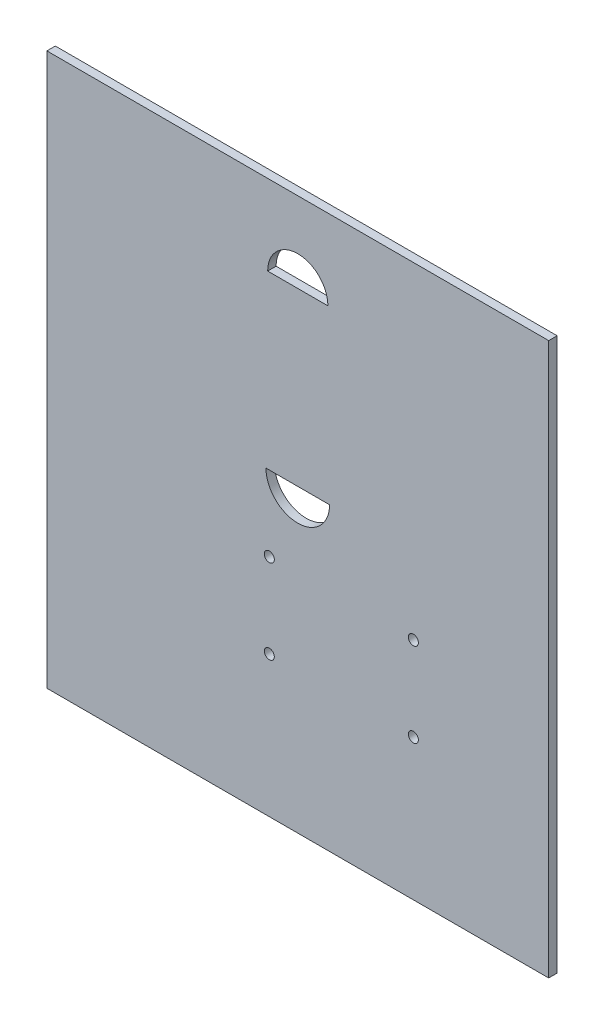
ISO-10303-21;
HEADER;
FILE_DESCRIPTION(('STEP AP214'),'2;1');
FILE_NAME('part.step','',(''),(''),'','','');
FILE_SCHEMA(('AUTOMOTIVE_DESIGN { 1 0 10303 214 1 1 1 1 }'));
ENDSEC;
DATA;
#1=APPLICATION_CONTEXT('core data for automotive mechanical design processes');
#2=APPLICATION_PROTOCOL_DEFINITION('international standard','automotive_design',2000,#1);
#3=PRODUCT_CONTEXT('',#1,'mechanical');
#4=PRODUCT('Part','Part','',(#3));
#5=PRODUCT_RELATED_PRODUCT_CATEGORY('part','',(#4));
#6=PRODUCT_DEFINITION_FORMATION('','',#4);
#7=PRODUCT_DEFINITION_CONTEXT('part definition',#1,'design');
#8=PRODUCT_DEFINITION('design','',#6,#7);
#9=PRODUCT_DEFINITION_SHAPE('','',#8);
#10=(LENGTH_UNIT() NAMED_UNIT(*) SI_UNIT(.MILLI.,.METRE.));
#11=(NAMED_UNIT(*) PLANE_ANGLE_UNIT() SI_UNIT($,.RADIAN.));
#12=(NAMED_UNIT(*) SI_UNIT($,.STERADIAN.) SOLID_ANGLE_UNIT());
#13=UNCERTAINTY_MEASURE_WITH_UNIT(LENGTH_MEASURE(1.E-05),#10,'distance_accuracy_value','');
#14=(GEOMETRIC_REPRESENTATION_CONTEXT(3) GLOBAL_UNCERTAINTY_ASSIGNED_CONTEXT((#13)) GLOBAL_UNIT_ASSIGNED_CONTEXT((#10,
#11,#12)) REPRESENTATION_CONTEXT('',''));
#15=CARTESIAN_POINT('',(0.,0.,0.));
#16=DIRECTION('',(0.,0.,1.));
#17=DIRECTION('',(1.,0.,0.));
#18=AXIS2_PLACEMENT_3D('',#15,#16,#17);
#19=CARTESIAN_POINT('',(-220.228215767635,110.114107883817,4.2));
#20=DIRECTION('',(1.,0.,0.));
#21=DIRECTION('',(0.,0.,-1.));
#22=AXIS2_PLACEMENT_3D('',#19,#20,#21);
#23=PLANE('',#22);
#24=DIRECTION('',(0.,-1.,0.));
#25=VECTOR('',#24,1.);
#26=CARTESIAN_POINT('',(-220.228215767635,110.114107883817,0.));
#27=LINE('',#26,#25);
#28=CARTESIAN_POINT('',(-220.228215767635,110.114107883817,0.));
#29=VERTEX_POINT('',#28);
#30=CARTESIAN_POINT('',(-220.228215767635,-164.885892116183,0.));
#31=VERTEX_POINT('',#30);
#32=EDGE_CURVE('E122',#29,#31,#27,.T.);
#33=ORIENTED_EDGE('',*,*,#32,.T.);
#34=DIRECTION('',(0.,0.,-1.));
#35=VECTOR('',#34,1.);
#36=CARTESIAN_POINT('',(-220.228215767635,-164.885892116183,4.2));
#37=LINE('',#36,#35);
#38=CARTESIAN_POINT('',(-220.228215767635,-164.885892116183,4.2));
#39=VERTEX_POINT('',#38);
#40=EDGE_CURVE('E11',#39,#31,#37,.T.);
#41=ORIENTED_EDGE('',*,*,#40,.F.);
#42=DIRECTION('',(0.,-1.,0.));
#43=VECTOR('',#42,1.);
#44=CARTESIAN_POINT('',(-220.228215767635,110.114107883817,4.2));
#45=LINE('',#44,#43);
#46=CARTESIAN_POINT('',(-220.228215767635,110.114107883817,4.2));
#47=VERTEX_POINT('',#46);
#48=EDGE_CURVE('E161',#47,#39,#45,.T.);
#49=ORIENTED_EDGE('',*,*,#48,.F.);
#50=DIRECTION('',(0.,0.,-1.));
#51=VECTOR('',#50,1.);
#52=CARTESIAN_POINT('',(-220.228215767635,110.114107883817,4.2));
#53=LINE('',#52,#51);
#54=EDGE_CURVE('E171',#47,#29,#53,.T.);
#55=ORIENTED_EDGE('',*,*,#54,.T.);
#56=EDGE_LOOP('',(#33,#41,#49,#55));
#57=FACE_BOUND('',#56,.T.);
#58=ADVANCED_FACE('F37',(#57),#23,.F.);
#59=CARTESIAN_POINT('',(-220.228215767635,-164.885892116183,4.2));
#60=DIRECTION('',(0.,1.,0.));
#61=DIRECTION('',(-1.,0.,0.));
#62=AXIS2_PLACEMENT_3D('',#59,#60,#61);
#63=PLANE('',#62);
#64=DIRECTION('',(1.,0.,0.));
#65=VECTOR('',#64,1.);
#66=CARTESIAN_POINT('',(-220.228215767635,-164.885892116183,0.));
#67=LINE('',#66,#65);
#68=CARTESIAN_POINT('',(29.7717842323652,-164.885892116183,0.));
#69=VERTEX_POINT('',#68);
#70=EDGE_CURVE('E174',#31,#69,#67,.T.);
#71=ORIENTED_EDGE('',*,*,#70,.T.);
#72=DIRECTION('',(0.,0.,-1.));
#73=VECTOR('',#72,1.);
#74=CARTESIAN_POINT('',(29.7717842323652,-164.885892116183,4.2));
#75=LINE('',#74,#73);
#76=CARTESIAN_POINT('',(29.7717842323652,-164.885892116183,4.2));
#77=VERTEX_POINT('',#76);
#78=EDGE_CURVE('E44',#77,#69,#75,.T.);
#79=ORIENTED_EDGE('',*,*,#78,.F.);
#80=DIRECTION('',(1.,0.,0.));
#81=VECTOR('',#80,1.);
#82=CARTESIAN_POINT('',(-220.228215767635,-164.885892116183,4.2));
#83=LINE('',#82,#81);
#84=EDGE_CURVE('E164',#39,#77,#83,.T.);
#85=ORIENTED_EDGE('',*,*,#84,.F.);
#86=ORIENTED_EDGE('',*,*,#40,.T.);
#87=EDGE_LOOP('',(#71,#79,#85,#86));
#88=FACE_BOUND('',#87,.T.);
#89=ADVANCED_FACE('F203',(#88),#63,.F.);
#90=CARTESIAN_POINT('',(29.7717842323651,110.114107883817,4.2));
#91=DIRECTION('',(-1.,0.,0.));
#92=DIRECTION('',(0.,-1.,0.));
#93=AXIS2_PLACEMENT_3D('',#90,#91,#92);
#94=PLANE('',#93);
#95=DIRECTION('',(0.,1.,0.));
#96=VECTOR('',#95,1.);
#97=CARTESIAN_POINT('',(29.7717842323651,110.114107883817,0.));
#98=LINE('',#97,#96);
#99=CARTESIAN_POINT('',(29.7717842323651,110.114107883817,0.));
#100=VERTEX_POINT('',#99);
#101=EDGE_CURVE('E176',#69,#100,#98,.T.);
#102=ORIENTED_EDGE('',*,*,#101,.T.);
#103=DIRECTION('',(0.,0.,-1.));
#104=VECTOR('',#103,1.);
#105=CARTESIAN_POINT('',(29.7717842323651,110.114107883817,4.2));
#106=LINE('',#105,#104);
#107=CARTESIAN_POINT('',(29.7717842323651,110.114107883817,4.2));
#108=VERTEX_POINT('',#107);
#109=EDGE_CURVE('E181',#108,#100,#106,.T.);
#110=ORIENTED_EDGE('',*,*,#109,.F.);
#111=DIRECTION('',(0.,1.,0.));
#112=VECTOR('',#111,1.);
#113=CARTESIAN_POINT('',(29.7717842323651,110.114107883817,4.2));
#114=LINE('',#113,#112);
#115=EDGE_CURVE('E167',#77,#108,#114,.T.);
#116=ORIENTED_EDGE('',*,*,#115,.F.);
#117=ORIENTED_EDGE('',*,*,#78,.T.);
#118=EDGE_LOOP('',(#102,#110,#116,#117));
#119=FACE_BOUND('',#118,.T.);
#120=ADVANCED_FACE('F188',(#119),#94,.F.);
#121=CARTESIAN_POINT('',(-220.228215767635,110.114107883817,4.2));
#122=DIRECTION('',(0.,-1.,0.));
#123=DIRECTION('',(0.,0.,-1.));
#124=AXIS2_PLACEMENT_3D('',#121,#122,#123);
#125=PLANE('',#124);
#126=DIRECTION('',(-1.,0.,0.));
#127=VECTOR('',#126,1.);
#128=CARTESIAN_POINT('',(-220.228215767635,110.114107883817,0.));
#129=LINE('',#128,#127);
#130=EDGE_CURVE('E165',#100,#29,#129,.T.);
#131=ORIENTED_EDGE('',*,*,#130,.T.);
#132=ORIENTED_EDGE('',*,*,#54,.F.);
#133=DIRECTION('',(-1.,0.,0.));
#134=VECTOR('',#133,1.);
#135=CARTESIAN_POINT('',(-220.228215767635,110.114107883817,4.2));
#136=LINE('',#135,#134);
#137=EDGE_CURVE('E169',#108,#47,#136,.T.);
#138=ORIENTED_EDGE('',*,*,#137,.F.);
#139=ORIENTED_EDGE('',*,*,#109,.T.);
#140=EDGE_LOOP('',(#131,#132,#138,#139));
#141=FACE_BOUND('',#140,.T.);
#142=ADVANCED_FACE('F196',(#141),#125,.F.);
#143=CARTESIAN_POINT('',(0.,0.,4.2));
#144=DIRECTION('',(0.,0.,1.));
#145=DIRECTION('',(1.,0.,0.));
#146=AXIS2_PLACEMENT_3D('',#143,#144,#145);
#147=PLANE('',#146);
#148=CARTESIAN_POINT('',(-95.2282157676349,70.1141078838174,4.2));
#149=DIRECTION('',(0.,0.,1.));
#150=DIRECTION('',(-1.,0.,0.));
#151=AXIS2_PLACEMENT_3D('',#148,#149,#150);
#152=CIRCLE('',#151,15.);
#153=CARTESIAN_POINT('',(-80.2282157676349,70.1141078838174,4.2));
#154=VERTEX_POINT('',#153);
#155=CARTESIAN_POINT('',(-110.228215767635,70.1141078838174,4.2));
#156=VERTEX_POINT('',#155);
#157=EDGE_CURVE('E51',#154,#156,#152,.T.);
#158=ORIENTED_EDGE('',*,*,#157,.F.);
#159=DIRECTION('',(1.,0.,0.));
#160=VECTOR('',#159,1.);
#161=CARTESIAN_POINT('',(-110.228215767635,70.1141078838174,4.2));
#162=LINE('',#161,#160);
#163=EDGE_CURVE('E116',#156,#154,#162,.T.);
#164=ORIENTED_EDGE('',*,*,#163,.F.);
#165=EDGE_LOOP('',(#158,#164));
#166=FACE_BOUND('',#165,.T.);
#167=CARTESIAN_POINT('',(-109.410669773119,-52.7391791909621,4.2));
#168=DIRECTION('',(0.,0.,1.));
#169=DIRECTION('',(1.,0.,0.));
#170=AXIS2_PLACEMENT_3D('',#167,#168,#169);
#171=CIRCLE('',#170,2.50000008);
#172=CARTESIAN_POINT('',(-106.910669693119,-52.7391791909621,4.2));
#173=VERTEX_POINT('',#172);
#174=EDGE_CURVE('E128',#173,#173,#171,.T.);
#175=ORIENTED_EDGE('',*,*,#174,.F.);
#176=EDGE_LOOP('',(#175));
#177=FACE_BOUND('',#176,.T.);
#178=CARTESIAN_POINT('',(-37.6556697731191,-94.6491791909619,4.2));
#179=DIRECTION('',(0.,0.,1.));
#180=DIRECTION('',(1.,0.,0.));
#181=AXIS2_PLACEMENT_3D('',#178,#179,#180);
#182=CIRCLE('',#181,2.50000007999997);
#183=CARTESIAN_POINT('',(-35.1556696931191,-94.6491791909619,4.2));
#184=VERTEX_POINT('',#183);
#185=EDGE_CURVE('E144',#184,#184,#182,.T.);
#186=ORIENTED_EDGE('',*,*,#185,.F.);
#187=EDGE_LOOP('',(#186));
#188=FACE_BOUND('',#187,.T.);
#189=CARTESIAN_POINT('',(-95.2282157676349,-15.3058921161826,4.2));
#190=DIRECTION('',(0.,0.,1.));
#191=DIRECTION('',(1.,0.,0.));
#192=AXIS2_PLACEMENT_3D('',#189,#190,#191);
#193=CIRCLE('',#192,15.8456781145647);
#194=CARTESIAN_POINT('',(-111.0738938822,-15.3058921161826,4.2));
#195=VERTEX_POINT('',#194);
#196=CARTESIAN_POINT('',(-79.3825376530702,-15.3058921161826,4.2));
#197=VERTEX_POINT('',#196);
#198=EDGE_CURVE('E59',#195,#197,#193,.T.);
#199=ORIENTED_EDGE('',*,*,#198,.F.);
#200=DIRECTION('',(-1.,0.,0.));
#201=VECTOR('',#200,1.);
#202=CARTESIAN_POINT('',(-111.0738938822,-15.3058921161826,4.2));
#203=LINE('',#202,#201);
#204=EDGE_CURVE('E152',#197,#195,#203,.T.);
#205=ORIENTED_EDGE('',*,*,#204,.F.);
#206=EDGE_LOOP('',(#199,#205));
#207=FACE_BOUND('',#206,.T.);
#208=CARTESIAN_POINT('',(-37.6556697731192,-52.7391791909619,4.2));
#209=DIRECTION('',(0.,0.,1.));
#210=DIRECTION('',(1.,0.,0.));
#211=AXIS2_PLACEMENT_3D('',#208,#209,#210);
#212=CIRCLE('',#211,2.50000008);
#213=CARTESIAN_POINT('',(-35.1556696931192,-52.7391791909619,4.2));
#214=VERTEX_POINT('',#213);
#215=EDGE_CURVE('E134',#214,#214,#212,.T.);
#216=ORIENTED_EDGE('',*,*,#215,.F.);
#217=EDGE_LOOP('',(#216));
#218=FACE_BOUND('',#217,.T.);
#219=CARTESIAN_POINT('',(-109.410669773119,-94.6491791909621,4.2));
#220=DIRECTION('',(0.,0.,1.));
#221=DIRECTION('',(1.,0.,0.));
#222=AXIS2_PLACEMENT_3D('',#219,#220,#221);
#223=CIRCLE('',#222,2.50000007999999);
#224=CARTESIAN_POINT('',(-106.910669693119,-94.6491791909621,4.2));
#225=VERTEX_POINT('',#224);
#226=EDGE_CURVE('E127',#225,#225,#223,.T.);
#227=ORIENTED_EDGE('',*,*,#226,.F.);
#228=EDGE_LOOP('',(#227));
#229=FACE_BOUND('',#228,.T.);
#230=ORIENTED_EDGE('',*,*,#48,.T.);
#231=ORIENTED_EDGE('',*,*,#84,.T.);
#232=ORIENTED_EDGE('',*,*,#115,.T.);
#233=ORIENTED_EDGE('',*,*,#137,.T.);
#234=EDGE_LOOP('',(#230,#231,#232,#233));
#235=FACE_BOUND('',#234,.T.);
#236=ADVANCED_FACE('F202',(#166,#177,#188,#207,#218,#229,#235),#147,.T.);
#237=CARTESIAN_POINT('',(0.,0.,0.));
#238=DIRECTION('',(0.,0.,1.));
#239=DIRECTION('',(1.,0.,0.));
#240=AXIS2_PLACEMENT_3D('',#237,#238,#239);
#241=PLANE('',#240);
#242=DIRECTION('',(1.,0.,0.));
#243=VECTOR('',#242,1.);
#244=CARTESIAN_POINT('',(-110.228215767635,70.1141078838174,0.));
#245=LINE('',#244,#243);
#246=CARTESIAN_POINT('',(-110.228215767635,70.1141078838174,0.));
#247=VERTEX_POINT('',#246);
#248=CARTESIAN_POINT('',(-80.2282157676349,70.1141078838174,0.));
#249=VERTEX_POINT('',#248);
#250=EDGE_CURVE('E108',#247,#249,#245,.T.);
#251=ORIENTED_EDGE('',*,*,#250,.T.);
#252=CARTESIAN_POINT('',(-95.2282157676349,70.1141078838174,0.));
#253=DIRECTION('',(0.,0.,1.));
#254=DIRECTION('',(-1.,0.,0.));
#255=AXIS2_PLACEMENT_3D('',#252,#253,#254);
#256=CIRCLE('',#255,15.);
#257=EDGE_CURVE('E102',#249,#247,#256,.T.);
#258=ORIENTED_EDGE('',*,*,#257,.T.);
#259=EDGE_LOOP('',(#251,#258));
#260=FACE_BOUND('',#259,.T.);
#261=CARTESIAN_POINT('',(-109.410669773119,-52.7391791909621,0.));
#262=DIRECTION('',(0.,0.,1.));
#263=DIRECTION('',(1.,0.,0.));
#264=AXIS2_PLACEMENT_3D('',#261,#262,#263);
#265=CIRCLE('',#264,2.50000008);
#266=CARTESIAN_POINT('',(-106.910669693119,-52.7391791909621,0.));
#267=VERTEX_POINT('',#266);
#268=EDGE_CURVE('E124',#267,#267,#265,.T.);
#269=ORIENTED_EDGE('',*,*,#268,.T.);
#270=EDGE_LOOP('',(#269));
#271=FACE_BOUND('',#270,.T.);
#272=CARTESIAN_POINT('',(-37.6556697731191,-94.6491791909619,0.));
#273=DIRECTION('',(0.,0.,1.));
#274=DIRECTION('',(1.,0.,0.));
#275=AXIS2_PLACEMENT_3D('',#272,#273,#274);
#276=CIRCLE('',#275,2.50000007999997);
#277=CARTESIAN_POINT('',(-35.1556696931191,-94.6491791909619,0.));
#278=VERTEX_POINT('',#277);
#279=EDGE_CURVE('E120',#278,#278,#276,.T.);
#280=ORIENTED_EDGE('',*,*,#279,.T.);
#281=EDGE_LOOP('',(#280));
#282=FACE_BOUND('',#281,.T.);
#283=DIRECTION('',(-1.,0.,0.));
#284=VECTOR('',#283,1.);
#285=CARTESIAN_POINT('',(-111.0738938822,-15.3058921161826,0.));
#286=LINE('',#285,#284);
#287=CARTESIAN_POINT('',(-79.3825376530702,-15.3058921161826,0.));
#288=VERTEX_POINT('',#287);
#289=CARTESIAN_POINT('',(-111.0738938822,-15.3058921161826,0.));
#290=VERTEX_POINT('',#289);
#291=EDGE_CURVE('E151',#288,#290,#286,.T.);
#292=ORIENTED_EDGE('',*,*,#291,.T.);
#293=CARTESIAN_POINT('',(-95.2282157676349,-15.3058921161826,0.));
#294=DIRECTION('',(0.,0.,1.));
#295=DIRECTION('',(1.,0.,0.));
#296=AXIS2_PLACEMENT_3D('',#293,#294,#295);
#297=CIRCLE('',#296,15.8456781145647);
#298=EDGE_CURVE('E148',#290,#288,#297,.T.);
#299=ORIENTED_EDGE('',*,*,#298,.T.);
#300=EDGE_LOOP('',(#292,#299));
#301=FACE_BOUND('',#300,.T.);
#302=CARTESIAN_POINT('',(-37.6556697731192,-52.7391791909619,0.));
#303=DIRECTION('',(0.,0.,1.));
#304=DIRECTION('',(1.,0.,0.));
#305=AXIS2_PLACEMENT_3D('',#302,#303,#304);
#306=CIRCLE('',#305,2.50000008);
#307=CARTESIAN_POINT('',(-35.1556696931192,-52.7391791909619,0.));
#308=VERTEX_POINT('',#307);
#309=EDGE_CURVE('E131',#308,#308,#306,.T.);
#310=ORIENTED_EDGE('',*,*,#309,.T.);
#311=EDGE_LOOP('',(#310));
#312=FACE_BOUND('',#311,.T.);
#313=CARTESIAN_POINT('',(-109.410669773119,-94.6491791909621,0.));
#314=DIRECTION('',(0.,0.,1.));
#315=DIRECTION('',(1.,0.,0.));
#316=AXIS2_PLACEMENT_3D('',#313,#314,#315);
#317=CIRCLE('',#316,2.50000007999999);
#318=CARTESIAN_POINT('',(-106.910669693119,-94.6491791909621,0.));
#319=VERTEX_POINT('',#318);
#320=EDGE_CURVE('E137',#319,#319,#317,.T.);
#321=ORIENTED_EDGE('',*,*,#320,.T.);
#322=EDGE_LOOP('',(#321));
#323=FACE_BOUND('',#322,.T.);
#324=ORIENTED_EDGE('',*,*,#32,.F.);
#325=ORIENTED_EDGE('',*,*,#130,.F.);
#326=ORIENTED_EDGE('',*,*,#101,.F.);
#327=ORIENTED_EDGE('',*,*,#70,.F.);
#328=EDGE_LOOP('',(#324,#325,#326,#327));
#329=FACE_BOUND('',#328,.T.);
#330=ADVANCED_FACE('F114',(#260,#271,#282,#301,#312,#323,#329),#241,.F.);
#331=CARTESIAN_POINT('',(-109.410669773119,-94.6491791909621,0.));
#332=DIRECTION('',(0.,0.,1.));
#333=DIRECTION('',(1.,0.,0.));
#334=AXIS2_PLACEMENT_3D('',#331,#332,#333);
#335=CYLINDRICAL_SURFACE('',#334,2.50000007999999);
#336=ORIENTED_EDGE('',*,*,#320,.F.);
#337=EDGE_LOOP('',(#336));
#338=FACE_BOUND('',#337,.T.);
#339=ORIENTED_EDGE('',*,*,#226,.T.);
#340=EDGE_LOOP('',(#339));
#341=FACE_BOUND('',#340,.T.);
#342=ADVANCED_FACE('F215',(#338,#341),#335,.F.);
#343=CARTESIAN_POINT('',(-37.6556697731192,-52.7391791909619,0.));
#344=DIRECTION('',(0.,0.,1.));
#345=DIRECTION('',(1.,0.,0.));
#346=AXIS2_PLACEMENT_3D('',#343,#344,#345);
#347=CYLINDRICAL_SURFACE('',#346,2.50000008);
#348=ORIENTED_EDGE('',*,*,#309,.F.);
#349=EDGE_LOOP('',(#348));
#350=FACE_BOUND('',#349,.T.);
#351=ORIENTED_EDGE('',*,*,#215,.T.);
#352=EDGE_LOOP('',(#351));
#353=FACE_BOUND('',#352,.T.);
#354=ADVANCED_FACE('F223',(#350,#353),#347,.F.);
#355=CARTESIAN_POINT('',(-95.2282157676349,-15.3058921161826,0.));
#356=DIRECTION('',(0.,0.,1.));
#357=DIRECTION('',(1.,0.,0.));
#358=AXIS2_PLACEMENT_3D('',#355,#356,#357);
#359=CYLINDRICAL_SURFACE('',#358,15.8456781145647);
#360=ORIENTED_EDGE('',*,*,#198,.T.);
#361=DIRECTION('',(0.,0.,1.));
#362=VECTOR('',#361,1.);
#363=CARTESIAN_POINT('',(-79.3825376530702,-15.3058921161826,0.));
#364=LINE('',#363,#362);
#365=EDGE_CURVE('E155',#288,#197,#364,.T.);
#366=ORIENTED_EDGE('',*,*,#365,.F.);
#367=ORIENTED_EDGE('',*,*,#298,.F.);
#368=DIRECTION('',(0.,0.,1.));
#369=VECTOR('',#368,1.);
#370=CARTESIAN_POINT('',(-111.0738938822,-15.3058921161826,0.));
#371=LINE('',#370,#369);
#372=EDGE_CURVE('E147',#290,#195,#371,.T.);
#373=ORIENTED_EDGE('',*,*,#372,.T.);
#374=EDGE_LOOP('',(#360,#366,#367,#373));
#375=FACE_BOUND('',#374,.T.);
#376=ADVANCED_FACE('F219',(#375),#359,.F.);
#377=CARTESIAN_POINT('',(-111.0738938822,-15.3058921161826,0.));
#378=DIRECTION('',(0.,1.,0.));
#379=DIRECTION('',(0.,0.,1.));
#380=AXIS2_PLACEMENT_3D('',#377,#378,#379);
#381=PLANE('',#380);
#382=ORIENTED_EDGE('',*,*,#204,.T.);
#383=ORIENTED_EDGE('',*,*,#372,.F.);
#384=ORIENTED_EDGE('',*,*,#291,.F.);
#385=ORIENTED_EDGE('',*,*,#365,.T.);
#386=EDGE_LOOP('',(#382,#383,#384,#385));
#387=FACE_BOUND('',#386,.T.);
#388=ADVANCED_FACE('F222',(#387),#381,.F.);
#389=CARTESIAN_POINT('',(-37.6556697731191,-94.6491791909619,0.));
#390=DIRECTION('',(0.,0.,1.));
#391=DIRECTION('',(1.,0.,0.));
#392=AXIS2_PLACEMENT_3D('',#389,#390,#391);
#393=CYLINDRICAL_SURFACE('',#392,2.50000007999997);
#394=ORIENTED_EDGE('',*,*,#279,.F.);
#395=EDGE_LOOP('',(#394));
#396=FACE_BOUND('',#395,.T.);
#397=ORIENTED_EDGE('',*,*,#185,.T.);
#398=EDGE_LOOP('',(#397));
#399=FACE_BOUND('',#398,.T.);
#400=ADVANCED_FACE('F226',(#396,#399),#393,.F.);
#401=CARTESIAN_POINT('',(-109.410669773119,-52.7391791909621,0.));
#402=DIRECTION('',(0.,0.,1.));
#403=DIRECTION('',(1.,0.,0.));
#404=AXIS2_PLACEMENT_3D('',#401,#402,#403);
#405=CYLINDRICAL_SURFACE('',#404,2.50000008);
#406=ORIENTED_EDGE('',*,*,#268,.F.);
#407=EDGE_LOOP('',(#406));
#408=FACE_BOUND('',#407,.T.);
#409=ORIENTED_EDGE('',*,*,#174,.T.);
#410=EDGE_LOOP('',(#409));
#411=FACE_BOUND('',#410,.T.);
#412=ADVANCED_FACE('F230',(#408,#411),#405,.F.);
#413=CARTESIAN_POINT('',(-95.2282157676349,70.1141078838174,0.));
#414=DIRECTION('',(0.,0.,1.));
#415=DIRECTION('',(1.,0.,0.));
#416=AXIS2_PLACEMENT_3D('',#413,#414,#415);
#417=CYLINDRICAL_SURFACE('',#416,15.);
#418=ORIENTED_EDGE('',*,*,#157,.T.);
#419=DIRECTION('',(0.,0.,1.));
#420=VECTOR('',#419,1.);
#421=CARTESIAN_POINT('',(-110.228215767635,70.1141078838174,0.));
#422=LINE('',#421,#420);
#423=EDGE_CURVE('E98',#247,#156,#422,.T.);
#424=ORIENTED_EDGE('',*,*,#423,.F.);
#425=ORIENTED_EDGE('',*,*,#257,.F.);
#426=DIRECTION('',(0.,0.,1.));
#427=VECTOR('',#426,1.);
#428=CARTESIAN_POINT('',(-80.2282157676349,70.1141078838174,0.));
#429=LINE('',#428,#427);
#430=EDGE_CURVE('E107',#249,#154,#429,.T.);
#431=ORIENTED_EDGE('',*,*,#430,.T.);
#432=EDGE_LOOP('',(#418,#424,#425,#431));
#433=FACE_BOUND('',#432,.T.);
#434=ADVANCED_FACE('F100',(#433),#417,.F.);
#435=CARTESIAN_POINT('',(-110.228215767635,70.1141078838174,0.));
#436=DIRECTION('',(0.,-1.,0.));
#437=DIRECTION('',(0.,0.,-1.));
#438=AXIS2_PLACEMENT_3D('',#435,#436,#437);
#439=PLANE('',#438);
#440=ORIENTED_EDGE('',*,*,#163,.T.);
#441=ORIENTED_EDGE('',*,*,#430,.F.);
#442=ORIENTED_EDGE('',*,*,#250,.F.);
#443=ORIENTED_EDGE('',*,*,#423,.T.);
#444=EDGE_LOOP('',(#440,#441,#442,#443));
#445=FACE_BOUND('',#444,.T.);
#446=ADVANCED_FACE('F111',(#445),#439,.F.);
#447=CLOSED_SHELL('',(#58,#89,#120,#142,#236,#330,#342,#354,#376,#388,#400,#412,#434,#446));
#448=MANIFOLD_SOLID_BREP('B2',#447);
#449=ADVANCED_BREP_SHAPE_REPRESENTATION('',(#18,#448),#14);
#450=SHAPE_DEFINITION_REPRESENTATION(#9,#449);
ENDSEC;
END-ISO-10303-21;
